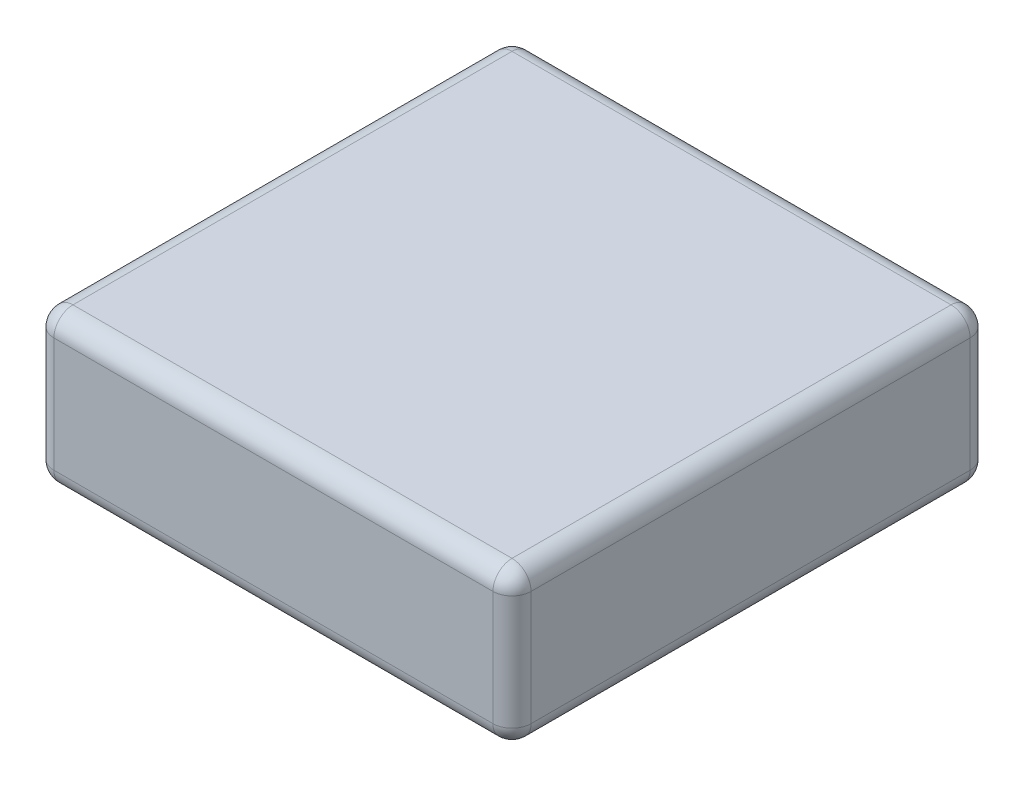
ISO-10303-21;
HEADER;
FILE_DESCRIPTION(('STEP AP214'),'2;1');
FILE_NAME('part.step','',(''),(''),'','','');
FILE_SCHEMA(('AUTOMOTIVE_DESIGN { 1 0 10303 214 1 1 1 1 }'));
ENDSEC;
DATA;
#1=APPLICATION_CONTEXT('core data for automotive mechanical design processes');
#2=APPLICATION_PROTOCOL_DEFINITION('international standard','automotive_design',2000,#1);
#3=PRODUCT_CONTEXT('',#1,'mechanical');
#4=PRODUCT('Part','Part','',(#3));
#5=PRODUCT_RELATED_PRODUCT_CATEGORY('part','',(#4));
#6=PRODUCT_DEFINITION_FORMATION('','',#4);
#7=PRODUCT_DEFINITION_CONTEXT('part definition',#1,'design');
#8=PRODUCT_DEFINITION('design','',#6,#7);
#9=PRODUCT_DEFINITION_SHAPE('','',#8);
#10=(LENGTH_UNIT() NAMED_UNIT(*) SI_UNIT(.MILLI.,.METRE.));
#11=(NAMED_UNIT(*) PLANE_ANGLE_UNIT() SI_UNIT($,.RADIAN.));
#12=(NAMED_UNIT(*) SI_UNIT($,.STERADIAN.) SOLID_ANGLE_UNIT());
#13=UNCERTAINTY_MEASURE_WITH_UNIT(LENGTH_MEASURE(1.E-05),#10,'distance_accuracy_value','');
#14=(GEOMETRIC_REPRESENTATION_CONTEXT(3) GLOBAL_UNCERTAINTY_ASSIGNED_CONTEXT((#13)) GLOBAL_UNIT_ASSIGNED_CONTEXT((#10,
#11,#12)) REPRESENTATION_CONTEXT('',''));
#15=CARTESIAN_POINT('',(0.,0.,0.));
#16=DIRECTION('',(0.,0.,1.));
#17=DIRECTION('',(1.,0.,0.));
#18=AXIS2_PLACEMENT_3D('',#15,#16,#17);
#19=CARTESIAN_POINT('',(-12.5,8.,12.5));
#20=DIRECTION('',(1.,0.,0.));
#21=DIRECTION('',(0.,0.,-1.));
#22=AXIS2_PLACEMENT_3D('',#19,#20,#21);
#23=PLANE('',#22);
#24=DIRECTION('',(0.,-1.,0.));
#25=VECTOR('',#24,1.);
#26=CARTESIAN_POINT('',(-12.5,8.,-11.5));
#27=LINE('',#26,#25);
#28=CARTESIAN_POINT('',(-12.5,7.,-11.5));
#29=VERTEX_POINT('',#28);
#30=CARTESIAN_POINT('',(-12.5,1.,-11.5));
#31=VERTEX_POINT('',#30);
#32=EDGE_CURVE('E167',#29,#31,#27,.T.);
#33=ORIENTED_EDGE('',*,*,#32,.T.);
#34=DIRECTION('',(0.,0.,1.));
#35=VECTOR('',#34,1.);
#36=CARTESIAN_POINT('',(-12.5,1.,12.5));
#37=LINE('',#36,#35);
#38=CARTESIAN_POINT('',(-12.5,1.,11.5));
#39=VERTEX_POINT('',#38);
#40=EDGE_CURVE('E172',#31,#39,#37,.T.);
#41=ORIENTED_EDGE('',*,*,#40,.T.);
#42=DIRECTION('',(0.,-1.,0.));
#43=VECTOR('',#42,1.);
#44=CARTESIAN_POINT('',(-12.5,8.,11.5));
#45=LINE('',#44,#43);
#46=CARTESIAN_POINT('',(-12.5,7.,11.5));
#47=VERTEX_POINT('',#46);
#48=EDGE_CURVE('E169',#39,#47,#45,.F.);
#49=ORIENTED_EDGE('',*,*,#48,.T.);
#50=DIRECTION('',(0.,0.,1.));
#51=VECTOR('',#50,1.);
#52=CARTESIAN_POINT('',(-12.5,7.,-12.5));
#53=LINE('',#52,#51);
#54=EDGE_CURVE('E165',#47,#29,#53,.F.);
#55=ORIENTED_EDGE('',*,*,#54,.T.);
#56=EDGE_LOOP('',(#33,#41,#49,#55));
#57=FACE_BOUND('',#56,.T.);
#58=ADVANCED_FACE('F34',(#57),#23,.F.);
#59=CARTESIAN_POINT('',(12.5,8.,12.5));
#60=DIRECTION('',(0.,0.,-1.));
#61=DIRECTION('',(-1.,0.,0.));
#62=AXIS2_PLACEMENT_3D('',#59,#60,#61);
#63=PLANE('',#62);
#64=DIRECTION('',(0.,-1.,0.));
#65=VECTOR('',#64,1.);
#66=CARTESIAN_POINT('',(-11.5,8.,12.5));
#67=LINE('',#66,#65);
#68=CARTESIAN_POINT('',(-11.5,7.,12.5));
#69=VERTEX_POINT('',#68);
#70=CARTESIAN_POINT('',(-11.5,1.,12.5));
#71=VERTEX_POINT('',#70);
#72=EDGE_CURVE('E133',#69,#71,#67,.T.);
#73=ORIENTED_EDGE('',*,*,#72,.T.);
#74=DIRECTION('',(1.,0.,0.));
#75=VECTOR('',#74,1.);
#76=CARTESIAN_POINT('',(12.5,1.,12.5));
#77=LINE('',#76,#75);
#78=CARTESIAN_POINT('',(11.5,1.,12.5));
#79=VERTEX_POINT('',#78);
#80=EDGE_CURVE('E129',#71,#79,#77,.T.);
#81=ORIENTED_EDGE('',*,*,#80,.T.);
#82=DIRECTION('',(0.,-1.,0.));
#83=VECTOR('',#82,1.);
#84=CARTESIAN_POINT('',(11.5,8.,12.5));
#85=LINE('',#84,#83);
#86=CARTESIAN_POINT('',(11.5,7.,12.5));
#87=VERTEX_POINT('',#86);
#88=EDGE_CURVE('E121',#79,#87,#85,.F.);
#89=ORIENTED_EDGE('',*,*,#88,.T.);
#90=DIRECTION('',(1.,0.,0.));
#91=VECTOR('',#90,1.);
#92=CARTESIAN_POINT('',(-12.5,7.,12.5));
#93=LINE('',#92,#91);
#94=EDGE_CURVE('E126',#87,#69,#93,.F.);
#95=ORIENTED_EDGE('',*,*,#94,.T.);
#96=EDGE_LOOP('',(#73,#81,#89,#95));
#97=FACE_BOUND('',#96,.T.);
#98=ADVANCED_FACE('F124',(#97),#63,.F.);
#99=CARTESIAN_POINT('',(12.5,8.,12.5));
#100=DIRECTION('',(-1.,0.,0.));
#101=DIRECTION('',(0.,0.,1.));
#102=AXIS2_PLACEMENT_3D('',#99,#100,#101);
#103=PLANE('',#102);
#104=DIRECTION('',(0.,-1.,0.));
#105=VECTOR('',#104,1.);
#106=CARTESIAN_POINT('',(12.5,8.,11.5));
#107=LINE('',#106,#105);
#108=CARTESIAN_POINT('',(12.5,7.,11.5));
#109=VERTEX_POINT('',#108);
#110=CARTESIAN_POINT('',(12.5,1.,11.5));
#111=VERTEX_POINT('',#110);
#112=EDGE_CURVE('E141',#109,#111,#107,.T.);
#113=ORIENTED_EDGE('',*,*,#112,.T.);
#114=DIRECTION('',(0.,0.,-1.));
#115=VECTOR('',#114,1.);
#116=CARTESIAN_POINT('',(12.5,1.,12.5));
#117=LINE('',#116,#115);
#118=CARTESIAN_POINT('',(12.5,1.,-11.5));
#119=VERTEX_POINT('',#118);
#120=EDGE_CURVE('E188',#111,#119,#117,.T.);
#121=ORIENTED_EDGE('',*,*,#120,.T.);
#122=DIRECTION('',(0.,-1.,0.));
#123=VECTOR('',#122,1.);
#124=CARTESIAN_POINT('',(12.5,8.,-11.5));
#125=LINE('',#124,#123);
#126=CARTESIAN_POINT('',(12.5,7.,-11.5));
#127=VERTEX_POINT('',#126);
#128=EDGE_CURVE('E185',#119,#127,#125,.F.);
#129=ORIENTED_EDGE('',*,*,#128,.T.);
#130=DIRECTION('',(0.,0.,-1.));
#131=VECTOR('',#130,1.);
#132=CARTESIAN_POINT('',(12.5,7.,12.5));
#133=LINE('',#132,#131);
#134=EDGE_CURVE('E183',#127,#109,#133,.F.);
#135=ORIENTED_EDGE('',*,*,#134,.T.);
#136=EDGE_LOOP('',(#113,#121,#129,#135));
#137=FACE_BOUND('',#136,.T.);
#138=ADVANCED_FACE('F297',(#137),#103,.F.);
#139=CARTESIAN_POINT('',(12.5,8.,-12.5));
#140=DIRECTION('',(0.,0.,1.));
#141=DIRECTION('',(1.,0.,0.));
#142=AXIS2_PLACEMENT_3D('',#139,#140,#141);
#143=PLANE('',#142);
#144=DIRECTION('',(0.,-1.,0.));
#145=VECTOR('',#144,1.);
#146=CARTESIAN_POINT('',(11.5,8.,-12.5));
#147=LINE('',#146,#145);
#148=CARTESIAN_POINT('',(11.5,7.,-12.5));
#149=VERTEX_POINT('',#148);
#150=CARTESIAN_POINT('',(11.5,1.,-12.5));
#151=VERTEX_POINT('',#150);
#152=EDGE_CURVE('E176',#149,#151,#147,.T.);
#153=ORIENTED_EDGE('',*,*,#152,.T.);
#154=DIRECTION('',(-1.,0.,0.));
#155=VECTOR('',#154,1.);
#156=CARTESIAN_POINT('',(12.5,1.,-12.5));
#157=LINE('',#156,#155);
#158=CARTESIAN_POINT('',(-11.5,1.,-12.5));
#159=VERTEX_POINT('',#158);
#160=EDGE_CURVE('E181',#151,#159,#157,.T.);
#161=ORIENTED_EDGE('',*,*,#160,.T.);
#162=DIRECTION('',(0.,-1.,0.));
#163=VECTOR('',#162,1.);
#164=CARTESIAN_POINT('',(-11.5,8.,-12.5));
#165=LINE('',#164,#163);
#166=CARTESIAN_POINT('',(-11.5,7.,-12.5));
#167=VERTEX_POINT('',#166);
#168=EDGE_CURVE('E178',#159,#167,#165,.F.);
#169=ORIENTED_EDGE('',*,*,#168,.T.);
#170=DIRECTION('',(-1.,0.,0.));
#171=VECTOR('',#170,1.);
#172=CARTESIAN_POINT('',(12.5,7.,-12.5));
#173=LINE('',#172,#171);
#174=EDGE_CURVE('E174',#167,#149,#173,.F.);
#175=ORIENTED_EDGE('',*,*,#174,.T.);
#176=EDGE_LOOP('',(#153,#161,#169,#175));
#177=FACE_BOUND('',#176,.T.);
#178=ADVANCED_FACE('F274',(#177),#143,.F.);
#179=CARTESIAN_POINT('',(0.,8.,0.));
#180=DIRECTION('',(0.,1.,0.));
#181=DIRECTION('',(0.,0.,1.));
#182=AXIS2_PLACEMENT_3D('',#179,#180,#181);
#183=PLANE('',#182);
#184=DIRECTION('',(0.,0.,-1.));
#185=VECTOR('',#184,1.);
#186=CARTESIAN_POINT('',(11.5,8.,-12.5));
#187=LINE('',#186,#185);
#188=CARTESIAN_POINT('',(11.5,8.,11.5));
#189=VERTEX_POINT('',#188);
#190=CARTESIAN_POINT('',(11.5,8.,-11.5));
#191=VERTEX_POINT('',#190);
#192=EDGE_CURVE('E43',#189,#191,#187,.T.);
#193=ORIENTED_EDGE('',*,*,#192,.T.);
#194=DIRECTION('',(-1.,0.,0.));
#195=VECTOR('',#194,1.);
#196=CARTESIAN_POINT('',(-12.5,8.,-11.5));
#197=LINE('',#196,#195);
#198=CARTESIAN_POINT('',(-11.5,8.,-11.5));
#199=VERTEX_POINT('',#198);
#200=EDGE_CURVE('E11',#191,#199,#197,.T.);
#201=ORIENTED_EDGE('',*,*,#200,.T.);
#202=DIRECTION('',(0.,0.,1.));
#203=VECTOR('',#202,1.);
#204=CARTESIAN_POINT('',(-11.5,8.,12.5));
#205=LINE('',#204,#203);
#206=CARTESIAN_POINT('',(-11.5,8.,11.5));
#207=VERTEX_POINT('',#206);
#208=EDGE_CURVE('E199',#199,#207,#205,.T.);
#209=ORIENTED_EDGE('',*,*,#208,.T.);
#210=DIRECTION('',(1.,0.,0.));
#211=VECTOR('',#210,1.);
#212=CARTESIAN_POINT('',(12.5,8.,11.5));
#213=LINE('',#212,#211);
#214=EDGE_CURVE('E54',#207,#189,#213,.T.);
#215=ORIENTED_EDGE('',*,*,#214,.T.);
#216=EDGE_LOOP('',(#193,#201,#209,#215));
#217=FACE_BOUND('',#216,.T.);
#218=ADVANCED_FACE('F304',(#217),#183,.T.);
#219=CARTESIAN_POINT('',(0.,0.,0.));
#220=DIRECTION('',(0.,1.,0.));
#221=DIRECTION('',(0.,0.,1.));
#222=AXIS2_PLACEMENT_3D('',#219,#220,#221);
#223=PLANE('',#222);
#224=DIRECTION('',(0.,0.,-1.));
#225=VECTOR('',#224,1.);
#226=CARTESIAN_POINT('',(11.5,0.,0.));
#227=LINE('',#226,#225);
#228=CARTESIAN_POINT('',(11.5,0.,-11.5));
#229=VERTEX_POINT('',#228);
#230=CARTESIAN_POINT('',(11.5,0.,11.5));
#231=VERTEX_POINT('',#230);
#232=EDGE_CURVE('E194',#229,#231,#227,.F.);
#233=ORIENTED_EDGE('',*,*,#232,.T.);
#234=DIRECTION('',(1.,0.,0.));
#235=VECTOR('',#234,1.);
#236=CARTESIAN_POINT('',(0.,0.,11.5));
#237=LINE('',#236,#235);
#238=CARTESIAN_POINT('',(-11.5,0.,11.5));
#239=VERTEX_POINT('',#238);
#240=EDGE_CURVE('E196',#231,#239,#237,.F.);
#241=ORIENTED_EDGE('',*,*,#240,.T.);
#242=DIRECTION('',(0.,0.,1.));
#243=VECTOR('',#242,1.);
#244=CARTESIAN_POINT('',(-11.5,0.,0.));
#245=LINE('',#244,#243);
#246=CARTESIAN_POINT('',(-11.5,0.,-11.5));
#247=VERTEX_POINT('',#246);
#248=EDGE_CURVE('E190',#239,#247,#245,.F.);
#249=ORIENTED_EDGE('',*,*,#248,.T.);
#250=DIRECTION('',(-1.,0.,0.));
#251=VECTOR('',#250,1.);
#252=CARTESIAN_POINT('',(0.,0.,-11.5));
#253=LINE('',#252,#251);
#254=EDGE_CURVE('E192',#247,#229,#253,.F.);
#255=ORIENTED_EDGE('',*,*,#254,.T.);
#256=EDGE_LOOP('',(#233,#241,#249,#255));
#257=FACE_BOUND('',#256,.T.);
#258=ADVANCED_FACE('F265',(#257),#223,.F.);
#259=CARTESIAN_POINT('',(11.5,8.,-11.5));
#260=DIRECTION('',(0.,-1.,0.));
#261=DIRECTION('',(0.,0.,-1.));
#262=AXIS2_PLACEMENT_3D('',#259,#260,#261);
#263=CYLINDRICAL_SURFACE('',#262,1.);
#264=CARTESIAN_POINT('',(11.5,7.,-11.5));
#265=DIRECTION('',(0.,1.,0.));
#266=DIRECTION('',(0.,0.,1.));
#267=AXIS2_PLACEMENT_3D('',#264,#265,#266);
#268=CIRCLE('',#267,1.);
#269=EDGE_CURVE('E38',#127,#149,#268,.T.);
#270=ORIENTED_EDGE('',*,*,#269,.F.);
#271=ORIENTED_EDGE('',*,*,#128,.F.);
#272=CARTESIAN_POINT('',(11.5,1.,-11.5));
#273=DIRECTION('',(0.,-1.,0.));
#274=DIRECTION('',(0.,0.,-1.));
#275=AXIS2_PLACEMENT_3D('',#272,#273,#274);
#276=CIRCLE('',#275,1.);
#277=EDGE_CURVE('E161',#151,#119,#276,.T.);
#278=ORIENTED_EDGE('',*,*,#277,.F.);
#279=ORIENTED_EDGE('',*,*,#152,.F.);
#280=EDGE_LOOP('',(#270,#271,#278,#279));
#281=FACE_BOUND('',#280,.T.);
#282=ADVANCED_FACE('F36',(#281),#263,.T.);
#283=CARTESIAN_POINT('',(11.5,7.,-11.5));
#284=DIRECTION('',(0.,0.,1.));
#285=DIRECTION('',(1.,0.,0.));
#286=AXIS2_PLACEMENT_3D('',#283,#284,#285);
#287=SPHERICAL_SURFACE('',#286,1.);
#288=CARTESIAN_POINT('',(11.5,7.,-11.5));
#289=DIRECTION('',(0.,0.,-1.));
#290=DIRECTION('',(-1.,0.,0.));
#291=AXIS2_PLACEMENT_3D('',#288,#289,#290);
#292=CIRCLE('',#291,1.);
#293=EDGE_CURVE('E244',#127,#191,#292,.F.);
#294=ORIENTED_EDGE('',*,*,#293,.F.);
#295=ORIENTED_EDGE('',*,*,#269,.T.);
#296=CARTESIAN_POINT('',(11.5,7.,-11.5));
#297=DIRECTION('',(1.,0.,0.));
#298=DIRECTION('',(0.,0.,-1.));
#299=AXIS2_PLACEMENT_3D('',#296,#297,#298);
#300=CIRCLE('',#299,1.);
#301=EDGE_CURVE('E246',#191,#149,#300,.F.);
#302=ORIENTED_EDGE('',*,*,#301,.F.);
#303=EDGE_LOOP('',(#294,#295,#302));
#304=FACE_BOUND('',#303,.T.);
#305=ADVANCED_FACE('F292',(#304),#287,.T.);
#306=CARTESIAN_POINT('',(11.5,1.,-11.5));
#307=DIRECTION('',(0.,0.,1.));
#308=DIRECTION('',(1.,0.,0.));
#309=AXIS2_PLACEMENT_3D('',#306,#307,#308);
#310=SPHERICAL_SURFACE('',#309,1.);
#311=CARTESIAN_POINT('',(11.5,1.,-11.5));
#312=DIRECTION('',(1.,0.,0.));
#313=DIRECTION('',(0.,0.,-1.));
#314=AXIS2_PLACEMENT_3D('',#311,#312,#313);
#315=CIRCLE('',#314,1.);
#316=EDGE_CURVE('E238',#151,#229,#315,.F.);
#317=ORIENTED_EDGE('',*,*,#316,.F.);
#318=ORIENTED_EDGE('',*,*,#277,.T.);
#319=CARTESIAN_POINT('',(11.5,1.,-11.5));
#320=DIRECTION('',(0.,0.,-1.));
#321=DIRECTION('',(-1.,0.,0.));
#322=AXIS2_PLACEMENT_3D('',#319,#320,#321);
#323=CIRCLE('',#322,1.);
#324=EDGE_CURVE('E241',#229,#119,#323,.F.);
#325=ORIENTED_EDGE('',*,*,#324,.F.);
#326=EDGE_LOOP('',(#317,#318,#325));
#327=FACE_BOUND('',#326,.T.);
#328=ADVANCED_FACE('F253',(#327),#310,.T.);
#329=CARTESIAN_POINT('',(0.,7.,-11.5));
#330=DIRECTION('',(1.,0.,0.));
#331=DIRECTION('',(0.,0.,-1.));
#332=AXIS2_PLACEMENT_3D('',#329,#330,#331);
#333=CYLINDRICAL_SURFACE('',#332,1.);
#334=ORIENTED_EDGE('',*,*,#301,.T.);
#335=ORIENTED_EDGE('',*,*,#174,.F.);
#336=CARTESIAN_POINT('',(-11.5,7.,-11.5));
#337=DIRECTION('',(-1.,0.,0.));
#338=DIRECTION('',(0.,0.,1.));
#339=AXIS2_PLACEMENT_3D('',#336,#337,#338);
#340=CIRCLE('',#339,1.);
#341=EDGE_CURVE('E233',#199,#167,#340,.T.);
#342=ORIENTED_EDGE('',*,*,#341,.F.);
#343=ORIENTED_EDGE('',*,*,#200,.F.);
#344=EDGE_LOOP('',(#334,#335,#342,#343));
#345=FACE_BOUND('',#344,.T.);
#346=ADVANCED_FACE('F286',(#345),#333,.T.);
#347=CARTESIAN_POINT('',(11.5,7.,0.));
#348=DIRECTION('',(0.,0.,1.));
#349=DIRECTION('',(1.,0.,0.));
#350=AXIS2_PLACEMENT_3D('',#347,#348,#349);
#351=CYLINDRICAL_SURFACE('',#350,1.);
#352=ORIENTED_EDGE('',*,*,#293,.T.);
#353=ORIENTED_EDGE('',*,*,#192,.F.);
#354=CARTESIAN_POINT('',(11.5,7.,11.5));
#355=DIRECTION('',(0.,0.,1.));
#356=DIRECTION('',(1.,0.,0.));
#357=AXIS2_PLACEMENT_3D('',#354,#355,#356);
#358=CIRCLE('',#357,1.);
#359=EDGE_CURVE('E145',#109,#189,#358,.T.);
#360=ORIENTED_EDGE('',*,*,#359,.F.);
#361=ORIENTED_EDGE('',*,*,#134,.F.);
#362=EDGE_LOOP('',(#352,#353,#360,#361));
#363=FACE_BOUND('',#362,.T.);
#364=ADVANCED_FACE('F295',(#363),#351,.T.);
#365=CARTESIAN_POINT('',(11.5,8.,11.5));
#366=DIRECTION('',(0.,-1.,0.));
#367=DIRECTION('',(0.,0.,-1.));
#368=AXIS2_PLACEMENT_3D('',#365,#366,#367);
#369=CYLINDRICAL_SURFACE('',#368,1.);
#370=CARTESIAN_POINT('',(11.5,1.,11.5));
#371=DIRECTION('',(0.,-1.,0.));
#372=DIRECTION('',(0.,0.,-1.));
#373=AXIS2_PLACEMENT_3D('',#370,#371,#372);
#374=CIRCLE('',#373,1.);
#375=EDGE_CURVE('E146',#111,#79,#374,.T.);
#376=ORIENTED_EDGE('',*,*,#375,.F.);
#377=ORIENTED_EDGE('',*,*,#112,.F.);
#378=CARTESIAN_POINT('',(11.5,7.,11.5));
#379=DIRECTION('',(0.,1.,0.));
#380=DIRECTION('',(0.,0.,1.));
#381=AXIS2_PLACEMENT_3D('',#378,#379,#380);
#382=CIRCLE('',#381,1.);
#383=EDGE_CURVE('E137',#87,#109,#382,.T.);
#384=ORIENTED_EDGE('',*,*,#383,.F.);
#385=ORIENTED_EDGE('',*,*,#88,.F.);
#386=EDGE_LOOP('',(#376,#377,#384,#385));
#387=FACE_BOUND('',#386,.T.);
#388=ADVANCED_FACE('F139',(#387),#369,.T.);
#389=CARTESIAN_POINT('',(11.5,1.,12.5));
#390=DIRECTION('',(0.,0.,-1.));
#391=DIRECTION('',(-1.,0.,0.));
#392=AXIS2_PLACEMENT_3D('',#389,#390,#391);
#393=CYLINDRICAL_SURFACE('',#392,1.);
#394=ORIENTED_EDGE('',*,*,#324,.T.);
#395=ORIENTED_EDGE('',*,*,#120,.F.);
#396=CARTESIAN_POINT('',(11.5,1.,11.5));
#397=DIRECTION('',(0.,0.,1.));
#398=DIRECTION('',(1.,0.,0.));
#399=AXIS2_PLACEMENT_3D('',#396,#397,#398);
#400=CIRCLE('',#399,1.);
#401=EDGE_CURVE('E229',#231,#111,#400,.T.);
#402=ORIENTED_EDGE('',*,*,#401,.F.);
#403=ORIENTED_EDGE('',*,*,#232,.F.);
#404=EDGE_LOOP('',(#394,#395,#402,#403));
#405=FACE_BOUND('',#404,.T.);
#406=ADVANCED_FACE('F261',(#405),#393,.T.);
#407=CARTESIAN_POINT('',(12.5,1.,-11.5));
#408=DIRECTION('',(-1.,0.,0.));
#409=DIRECTION('',(0.,0.,1.));
#410=AXIS2_PLACEMENT_3D('',#407,#408,#409);
#411=CYLINDRICAL_SURFACE('',#410,1.);
#412=ORIENTED_EDGE('',*,*,#316,.T.);
#413=ORIENTED_EDGE('',*,*,#254,.F.);
#414=CARTESIAN_POINT('',(-11.5,1.,-11.5));
#415=DIRECTION('',(-1.,0.,0.));
#416=DIRECTION('',(0.,0.,1.));
#417=AXIS2_PLACEMENT_3D('',#414,#415,#416);
#418=CIRCLE('',#417,1.);
#419=EDGE_CURVE('E226',#159,#247,#418,.T.);
#420=ORIENTED_EDGE('',*,*,#419,.F.);
#421=ORIENTED_EDGE('',*,*,#160,.F.);
#422=EDGE_LOOP('',(#412,#413,#420,#421));
#423=FACE_BOUND('',#422,.T.);
#424=ADVANCED_FACE('F271',(#423),#411,.T.);
#425=CARTESIAN_POINT('',(-11.5,8.,-11.5));
#426=DIRECTION('',(0.,-1.,0.));
#427=DIRECTION('',(0.,0.,-1.));
#428=AXIS2_PLACEMENT_3D('',#425,#426,#427);
#429=CYLINDRICAL_SURFACE('',#428,1.);
#430=CARTESIAN_POINT('',(-11.5,7.,-11.5));
#431=DIRECTION('',(0.,1.,0.));
#432=DIRECTION('',(0.,0.,1.));
#433=AXIS2_PLACEMENT_3D('',#430,#431,#432);
#434=CIRCLE('',#433,1.);
#435=EDGE_CURVE('E235',#167,#29,#434,.T.);
#436=ORIENTED_EDGE('',*,*,#435,.F.);
#437=ORIENTED_EDGE('',*,*,#168,.F.);
#438=CARTESIAN_POINT('',(-11.5,1.,-11.5));
#439=DIRECTION('',(0.,-1.,0.));
#440=DIRECTION('',(0.,0.,-1.));
#441=AXIS2_PLACEMENT_3D('',#438,#439,#440);
#442=CIRCLE('',#441,1.);
#443=EDGE_CURVE('E223',#31,#159,#442,.T.);
#444=ORIENTED_EDGE('',*,*,#443,.F.);
#445=ORIENTED_EDGE('',*,*,#32,.F.);
#446=EDGE_LOOP('',(#436,#437,#444,#445));
#447=FACE_BOUND('',#446,.T.);
#448=ADVANCED_FACE('F278',(#447),#429,.T.);
#449=CARTESIAN_POINT('',(-11.5,7.,-11.5));
#450=DIRECTION('',(0.,0.,1.));
#451=DIRECTION('',(1.,0.,0.));
#452=AXIS2_PLACEMENT_3D('',#449,#450,#451);
#453=SPHERICAL_SURFACE('',#452,1.);
#454=ORIENTED_EDGE('',*,*,#341,.T.);
#455=ORIENTED_EDGE('',*,*,#435,.T.);
#456=CARTESIAN_POINT('',(-11.5,7.,-11.5));
#457=DIRECTION('',(0.,0.,-1.));
#458=DIRECTION('',(-1.,0.,0.));
#459=AXIS2_PLACEMENT_3D('',#456,#457,#458);
#460=CIRCLE('',#459,1.);
#461=EDGE_CURVE('E152',#199,#29,#460,.F.);
#462=ORIENTED_EDGE('',*,*,#461,.F.);
#463=EDGE_LOOP('',(#454,#455,#462));
#464=FACE_BOUND('',#463,.T.);
#465=ADVANCED_FACE('F349',(#464),#453,.T.);
#466=CARTESIAN_POINT('',(11.5,7.,11.5));
#467=DIRECTION('',(0.,0.,1.));
#468=DIRECTION('',(1.,0.,0.));
#469=AXIS2_PLACEMENT_3D('',#466,#467,#468);
#470=SPHERICAL_SURFACE('',#469,1.);
#471=ORIENTED_EDGE('',*,*,#383,.T.);
#472=ORIENTED_EDGE('',*,*,#359,.T.);
#473=CARTESIAN_POINT('',(11.5,7.,11.5));
#474=DIRECTION('',(1.,0.,0.));
#475=DIRECTION('',(0.,0.,-1.));
#476=AXIS2_PLACEMENT_3D('',#473,#474,#475);
#477=CIRCLE('',#476,1.);
#478=EDGE_CURVE('E149',#87,#189,#477,.F.);
#479=ORIENTED_EDGE('',*,*,#478,.F.);
#480=EDGE_LOOP('',(#471,#472,#479));
#481=FACE_BOUND('',#480,.T.);
#482=ADVANCED_FACE('F150',(#481),#470,.T.);
#483=CARTESIAN_POINT('',(11.5,1.,11.5));
#484=DIRECTION('',(0.,0.,1.));
#485=DIRECTION('',(1.,0.,0.));
#486=AXIS2_PLACEMENT_3D('',#483,#484,#485);
#487=SPHERICAL_SURFACE('',#486,1.);
#488=ORIENTED_EDGE('',*,*,#401,.T.);
#489=ORIENTED_EDGE('',*,*,#375,.T.);
#490=CARTESIAN_POINT('',(11.5,1.,11.5));
#491=DIRECTION('',(1.,0.,0.));
#492=DIRECTION('',(0.,0.,-1.));
#493=AXIS2_PLACEMENT_3D('',#490,#491,#492);
#494=CIRCLE('',#493,1.);
#495=EDGE_CURVE('E153',#231,#79,#494,.F.);
#496=ORIENTED_EDGE('',*,*,#495,.F.);
#497=EDGE_LOOP('',(#488,#489,#496));
#498=FACE_BOUND('',#497,.T.);
#499=ADVANCED_FACE('F342',(#498),#487,.T.);
#500=CARTESIAN_POINT('',(-11.5,1.,-11.5));
#501=DIRECTION('',(0.,0.,1.));
#502=DIRECTION('',(1.,0.,0.));
#503=AXIS2_PLACEMENT_3D('',#500,#501,#502);
#504=SPHERICAL_SURFACE('',#503,1.);
#505=ORIENTED_EDGE('',*,*,#443,.T.);
#506=ORIENTED_EDGE('',*,*,#419,.T.);
#507=CARTESIAN_POINT('',(-11.5,1.,-11.5));
#508=DIRECTION('',(0.,0.,-1.));
#509=DIRECTION('',(-1.,0.,0.));
#510=AXIS2_PLACEMENT_3D('',#507,#508,#509);
#511=CIRCLE('',#510,1.);
#512=EDGE_CURVE('E216',#31,#247,#511,.F.);
#513=ORIENTED_EDGE('',*,*,#512,.F.);
#514=EDGE_LOOP('',(#505,#506,#513));
#515=FACE_BOUND('',#514,.T.);
#516=ADVANCED_FACE('F338',(#515),#504,.T.);
#517=CARTESIAN_POINT('',(-11.5,7.,0.));
#518=DIRECTION('',(0.,0.,-1.));
#519=DIRECTION('',(-1.,0.,0.));
#520=AXIS2_PLACEMENT_3D('',#517,#518,#519);
#521=CYLINDRICAL_SURFACE('',#520,1.);
#522=ORIENTED_EDGE('',*,*,#461,.T.);
#523=ORIENTED_EDGE('',*,*,#54,.F.);
#524=CARTESIAN_POINT('',(-11.5,7.,11.5));
#525=DIRECTION('',(0.,0.,1.));
#526=DIRECTION('',(1.,0.,0.));
#527=AXIS2_PLACEMENT_3D('',#524,#525,#526);
#528=CIRCLE('',#527,1.);
#529=EDGE_CURVE('E213',#207,#47,#528,.T.);
#530=ORIENTED_EDGE('',*,*,#529,.F.);
#531=ORIENTED_EDGE('',*,*,#208,.F.);
#532=EDGE_LOOP('',(#522,#523,#530,#531));
#533=FACE_BOUND('',#532,.T.);
#534=ADVANCED_FACE('F335',(#533),#521,.T.);
#535=CARTESIAN_POINT('',(0.,7.,11.5));
#536=DIRECTION('',(-1.,0.,0.));
#537=DIRECTION('',(0.,0.,1.));
#538=AXIS2_PLACEMENT_3D('',#535,#536,#537);
#539=CYLINDRICAL_SURFACE('',#538,1.);
#540=ORIENTED_EDGE('',*,*,#478,.T.);
#541=ORIENTED_EDGE('',*,*,#214,.F.);
#542=CARTESIAN_POINT('',(-11.5,7.,11.5));
#543=DIRECTION('',(-1.,0.,0.));
#544=DIRECTION('',(0.,0.,1.));
#545=AXIS2_PLACEMENT_3D('',#542,#543,#544);
#546=CIRCLE('',#545,1.);
#547=EDGE_CURVE('E157',#69,#207,#546,.T.);
#548=ORIENTED_EDGE('',*,*,#547,.F.);
#549=ORIENTED_EDGE('',*,*,#94,.F.);
#550=EDGE_LOOP('',(#540,#541,#548,#549));
#551=FACE_BOUND('',#550,.T.);
#552=ADVANCED_FACE('F155',(#551),#539,.T.);
#553=CARTESIAN_POINT('',(12.5,1.,11.5));
#554=DIRECTION('',(1.,0.,0.));
#555=DIRECTION('',(0.,0.,-1.));
#556=AXIS2_PLACEMENT_3D('',#553,#554,#555);
#557=CYLINDRICAL_SURFACE('',#556,1.);
#558=ORIENTED_EDGE('',*,*,#495,.T.);
#559=ORIENTED_EDGE('',*,*,#80,.F.);
#560=CARTESIAN_POINT('',(-11.5,1.,11.5));
#561=DIRECTION('',(-1.,0.,0.));
#562=DIRECTION('',(0.,0.,1.));
#563=AXIS2_PLACEMENT_3D('',#560,#561,#562);
#564=CIRCLE('',#563,1.);
#565=EDGE_CURVE('E209',#239,#71,#564,.T.);
#566=ORIENTED_EDGE('',*,*,#565,.F.);
#567=ORIENTED_EDGE('',*,*,#240,.F.);
#568=EDGE_LOOP('',(#558,#559,#566,#567));
#569=FACE_BOUND('',#568,.T.);
#570=ADVANCED_FACE('F328',(#569),#557,.T.);
#571=CARTESIAN_POINT('',(-11.5,1.,12.5));
#572=DIRECTION('',(0.,0.,1.));
#573=DIRECTION('',(1.,0.,0.));
#574=AXIS2_PLACEMENT_3D('',#571,#572,#573);
#575=CYLINDRICAL_SURFACE('',#574,1.);
#576=ORIENTED_EDGE('',*,*,#512,.T.);
#577=ORIENTED_EDGE('',*,*,#248,.F.);
#578=CARTESIAN_POINT('',(-11.5,1.,11.5));
#579=DIRECTION('',(0.,0.,1.));
#580=DIRECTION('',(1.,0.,0.));
#581=AXIS2_PLACEMENT_3D('',#578,#579,#580);
#582=CIRCLE('',#581,1.);
#583=EDGE_CURVE('E207',#39,#239,#582,.T.);
#584=ORIENTED_EDGE('',*,*,#583,.F.);
#585=ORIENTED_EDGE('',*,*,#40,.F.);
#586=EDGE_LOOP('',(#576,#577,#584,#585));
#587=FACE_BOUND('',#586,.T.);
#588=ADVANCED_FACE('F324',(#587),#575,.T.);
#589=CARTESIAN_POINT('',(-11.5,7.,11.5));
#590=DIRECTION('',(0.,0.,1.));
#591=DIRECTION('',(1.,0.,0.));
#592=AXIS2_PLACEMENT_3D('',#589,#590,#591);
#593=SPHERICAL_SURFACE('',#592,1.);
#594=ORIENTED_EDGE('',*,*,#547,.T.);
#595=ORIENTED_EDGE('',*,*,#529,.T.);
#596=CARTESIAN_POINT('',(-11.5,7.,11.5));
#597=DIRECTION('',(0.,1.,0.));
#598=DIRECTION('',(0.,0.,1.));
#599=AXIS2_PLACEMENT_3D('',#596,#597,#598);
#600=CIRCLE('',#599,1.);
#601=EDGE_CURVE('E205',#69,#47,#600,.F.);
#602=ORIENTED_EDGE('',*,*,#601,.F.);
#603=EDGE_LOOP('',(#594,#595,#602));
#604=FACE_BOUND('',#603,.T.);
#605=ADVANCED_FACE('F320',(#604),#593,.T.);
#606=CARTESIAN_POINT('',(-11.5,1.,11.5));
#607=DIRECTION('',(0.,0.,1.));
#608=DIRECTION('',(1.,0.,0.));
#609=AXIS2_PLACEMENT_3D('',#606,#607,#608);
#610=SPHERICAL_SURFACE('',#609,1.);
#611=ORIENTED_EDGE('',*,*,#583,.T.);
#612=ORIENTED_EDGE('',*,*,#565,.T.);
#613=CARTESIAN_POINT('',(-11.5,1.,11.5));
#614=DIRECTION('',(0.,-1.,0.));
#615=DIRECTION('',(0.,0.,-1.));
#616=AXIS2_PLACEMENT_3D('',#613,#614,#615);
#617=CIRCLE('',#616,1.);
#618=EDGE_CURVE('E203',#39,#71,#617,.F.);
#619=ORIENTED_EDGE('',*,*,#618,.F.);
#620=EDGE_LOOP('',(#611,#612,#619));
#621=FACE_BOUND('',#620,.T.);
#622=ADVANCED_FACE('F316',(#621),#610,.T.);
#623=CARTESIAN_POINT('',(-11.5,8.,11.5));
#624=DIRECTION('',(0.,-1.,0.));
#625=DIRECTION('',(0.,0.,-1.));
#626=AXIS2_PLACEMENT_3D('',#623,#624,#625);
#627=CYLINDRICAL_SURFACE('',#626,1.);
#628=ORIENTED_EDGE('',*,*,#601,.T.);
#629=ORIENTED_EDGE('',*,*,#48,.F.);
#630=ORIENTED_EDGE('',*,*,#618,.T.);
#631=ORIENTED_EDGE('',*,*,#72,.F.);
#632=EDGE_LOOP('',(#628,#629,#630,#631));
#633=FACE_BOUND('',#632,.T.);
#634=ADVANCED_FACE('F313',(#633),#627,.T.);
#635=CLOSED_SHELL('',(#58,#98,#138,#178,#218,#258,#282,#305,#328,#346,#364,#388,#406,#424,#448,
#465,#482,#499,#516,#534,#552,#570,#588,#605,#622,#634));
#636=MANIFOLD_SOLID_BREP('B2',#635);
#637=ADVANCED_BREP_SHAPE_REPRESENTATION('',(#18,#636),#14);
#638=SHAPE_DEFINITION_REPRESENTATION(#9,#637);
ENDSEC;
END-ISO-10303-21;
